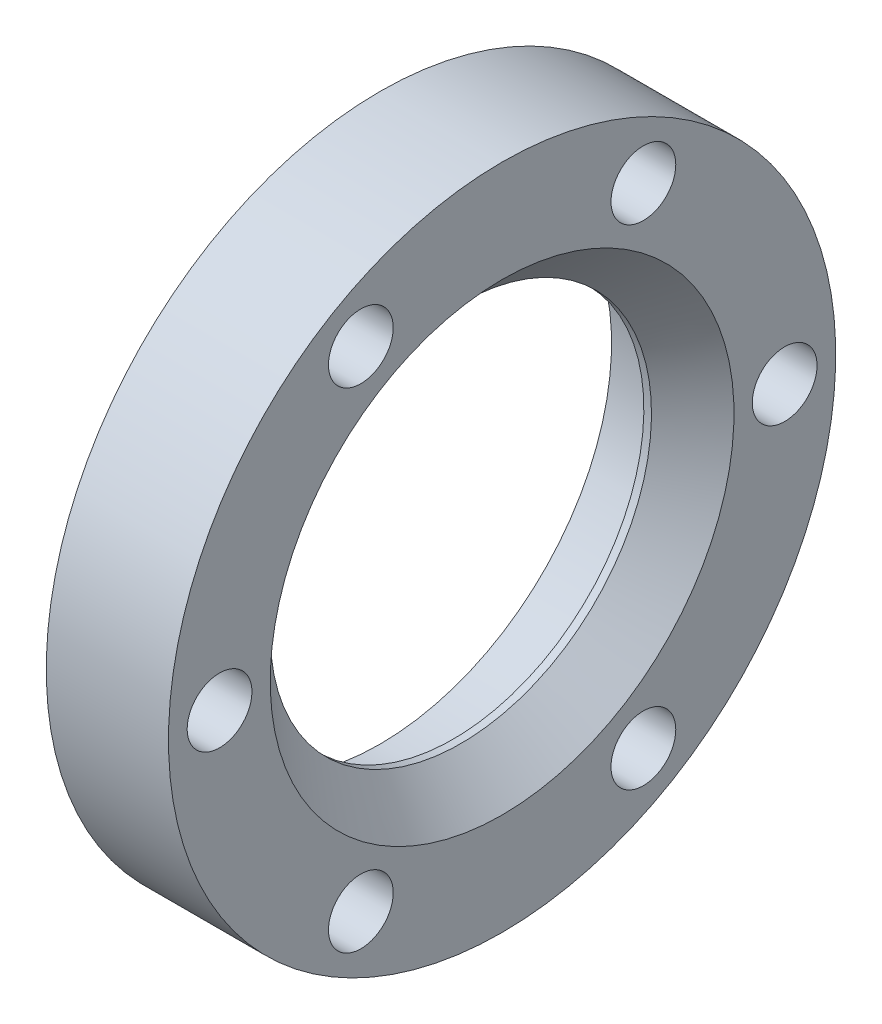
ISO-10303-21;
HEADER;
FILE_DESCRIPTION(('STEP AP214'),'2;1');
FILE_NAME('part.step','',(''),(''),'','','');
FILE_SCHEMA(('AUTOMOTIVE_DESIGN { 1 0 10303 214 1 1 1 1 }'));
ENDSEC;
DATA;
#1=APPLICATION_CONTEXT('core data for automotive mechanical design processes');
#2=APPLICATION_PROTOCOL_DEFINITION('international standard','automotive_design',2000,#1);
#3=PRODUCT_CONTEXT('',#1,'mechanical');
#4=PRODUCT('Part','Part','',(#3));
#5=PRODUCT_RELATED_PRODUCT_CATEGORY('part','',(#4));
#6=PRODUCT_DEFINITION_FORMATION('','',#4);
#7=PRODUCT_DEFINITION_CONTEXT('part definition',#1,'design');
#8=PRODUCT_DEFINITION('design','',#6,#7);
#9=PRODUCT_DEFINITION_SHAPE('','',#8);
#10=(LENGTH_UNIT() NAMED_UNIT(*) SI_UNIT(.MILLI.,.METRE.));
#11=(NAMED_UNIT(*) PLANE_ANGLE_UNIT() SI_UNIT($,.RADIAN.));
#12=(NAMED_UNIT(*) SI_UNIT($,.STERADIAN.) SOLID_ANGLE_UNIT());
#13=UNCERTAINTY_MEASURE_WITH_UNIT(LENGTH_MEASURE(1.E-05),#10,'distance_accuracy_value','');
#14=(GEOMETRIC_REPRESENTATION_CONTEXT(3) GLOBAL_UNCERTAINTY_ASSIGNED_CONTEXT((#13)) GLOBAL_UNIT_ASSIGNED_CONTEXT((#10,
#11,#12)) REPRESENTATION_CONTEXT('',''));
#15=CARTESIAN_POINT('',(0.,0.,0.));
#16=DIRECTION('',(0.,0.,1.));
#17=DIRECTION('',(1.,0.,0.));
#18=AXIS2_PLACEMENT_3D('',#15,#16,#17);
#19=CARTESIAN_POINT('',(8.01687499999896,0.,0.));
#20=DIRECTION('',(1.,0.,0.));
#21=DIRECTION('',(0.,1.,0.));
#22=AXIS2_PLACEMENT_3D('',#19,#20,#21);
#23=CYLINDRICAL_SURFACE('',#22,19.8120000000008);
#24=CARTESIAN_POINT('',(8.41374999807562,0.,0.));
#25=DIRECTION('',(1.,0.,0.));
#26=DIRECTION('',(0.,1.,0.));
#27=AXIS2_PLACEMENT_3D('',#24,#25,#26);
#28=CIRCLE('',#27,19.8120000019241);
#29=CARTESIAN_POINT('',(8.41374999807565,19.8120000019241,0.));
#30=VERTEX_POINT('',#29);
#31=EDGE_CURVE('E76',#30,#30,#28,.T.);
#32=ORIENTED_EDGE('',*,*,#31,.T.);
#33=EDGE_LOOP('',(#32));
#34=FACE_BOUND('',#33,.T.);
#35=CARTESIAN_POINT('',(7.61999999999895,0.,0.));
#36=DIRECTION('',(1.,0.,0.));
#37=DIRECTION('',(0.,1.,0.));
#38=AXIS2_PLACEMENT_3D('',#35,#36,#37);
#39=CIRCLE('',#38,19.8120000000008);
#40=CARTESIAN_POINT('',(7.61999999999898,19.8120000000008,0.));
#41=VERTEX_POINT('',#40);
#42=EDGE_CURVE('E19',#41,#41,#39,.T.);
#43=ORIENTED_EDGE('',*,*,#42,.F.);
#44=EDGE_LOOP('',(#43));
#45=FACE_BOUND('',#44,.T.);
#46=ADVANCED_FACE('F15',(#34,#45),#23,.F.);
#47=CARTESIAN_POINT('',(7.61999999999898,21.9437000000006,0.));
#48=DIRECTION('',(-1.,0.,0.));
#49=DIRECTION('',(0.,0.,1.));
#50=AXIS2_PLACEMENT_3D('',#47,#48,#49);
#51=PLANE('',#50);
#52=ORIENTED_EDGE('',*,*,#42,.T.);
#53=EDGE_LOOP('',(#52));
#54=FACE_BOUND('',#53,.T.);
#55=CARTESIAN_POINT('',(7.61999999999894,0.,0.));
#56=DIRECTION('',(1.,0.,0.));
#57=DIRECTION('',(0.,1.,0.));
#58=AXIS2_PLACEMENT_3D('',#55,#56,#57);
#59=CIRCLE('',#58,24.0754000000004);
#60=CARTESIAN_POINT('',(7.61999999999898,24.0754000000004,0.));
#61=VERTEX_POINT('',#60);
#62=EDGE_CURVE('E74',#61,#61,#59,.F.);
#63=ORIENTED_EDGE('',*,*,#62,.T.);
#64=EDGE_LOOP('',(#63));
#65=FACE_BOUND('',#64,.T.);
#66=ADVANCED_FACE('F85',(#54,#65),#51,.T.);
#67=CARTESIAN_POINT('',(12.7000000019235,0.,0.));
#68=DIRECTION('',(1.,0.,0.));
#69=DIRECTION('',(0.,1.,0.));
#70=AXIS2_PLACEMENT_3D('',#67,#68,#69);
#71=CONICAL_SURFACE('',#70,24.0982499980792,0.78539816250007);
#72=CARTESIAN_POINT('',(12.7000000019235,0.,0.));
#73=DIRECTION('',(1.,0.,0.));
#74=DIRECTION('',(0.,1.,0.));
#75=AXIS2_PLACEMENT_3D('',#72,#73,#74);
#76=CIRCLE('',#75,24.0982499980792);
#77=CARTESIAN_POINT('',(12.7000000019235,24.0982499980792,0.));
#78=VERTEX_POINT('',#77);
#79=EDGE_CURVE('E54',#78,#78,#76,.F.);
#80=ORIENTED_EDGE('',*,*,#79,.F.);
#81=EDGE_LOOP('',(#80));
#82=FACE_BOUND('',#81,.T.);
#83=ORIENTED_EDGE('',*,*,#31,.F.);
#84=EDGE_LOOP('',(#83));
#85=FACE_BOUND('',#84,.T.);
#86=ADVANCED_FACE('F93',(#82,#85),#71,.F.);
#87=CARTESIAN_POINT('',(1.240785174E-13,25.4285843160802,-14.6812));
#88=DIRECTION('',(1.,0.,0.));
#89=DIRECTION('',(0.,0.,-1.));
#90=AXIS2_PLACEMENT_3D('',#87,#88,#89);
#91=CYLINDRICAL_SURFACE('',#90,3.36549999999999);
#92=CARTESIAN_POINT('',(1.35358378E-13,25.4285843160802,-14.6812));
#93=DIRECTION('',(1.,0.,0.));
#94=DIRECTION('',(0.,0.,-1.));
#95=AXIS2_PLACEMENT_3D('',#92,#93,#94);
#96=CIRCLE('',#95,3.36549999999999);
#97=CARTESIAN_POINT('',(1.32693040020406E-13,25.4285843160802,-18.0467));
#98=VERTEX_POINT('',#97);
#99=EDGE_CURVE('E51',#98,#98,#96,.T.);
#100=ORIENTED_EDGE('',*,*,#99,.F.);
#101=EDGE_LOOP('',(#100));
#102=FACE_BOUND('',#101,.T.);
#103=CARTESIAN_POINT('',(12.7000000000002,25.4285843160802,-14.6812));
#104=DIRECTION('',(1.,0.,0.));
#105=DIRECTION('',(0.,0.,-1.));
#106=AXIS2_PLACEMENT_3D('',#103,#104,#105);
#107=CIRCLE('',#106,3.36549999999999);
#108=CARTESIAN_POINT('',(12.7000000000002,25.4285843160802,-18.0467));
#109=VERTEX_POINT('',#108);
#110=EDGE_CURVE('E72',#109,#109,#107,.F.);
#111=ORIENTED_EDGE('',*,*,#110,.F.);
#112=EDGE_LOOP('',(#111));
#113=FACE_BOUND('',#112,.T.);
#114=ADVANCED_FACE('F116',(#102,#113),#91,.F.);
#115=CARTESIAN_POINT('',(0.,0.,-29.3624));
#116=DIRECTION('',(1.,0.,0.));
#117=DIRECTION('',(0.,1.,0.));
#118=AXIS2_PLACEMENT_3D('',#115,#116,#117);
#119=CYLINDRICAL_SURFACE('',#118,3.3655);
#120=CARTESIAN_POINT('',(1.35358378E-13,0.,-29.3624));
#121=DIRECTION('',(1.,0.,0.));
#122=DIRECTION('',(0.,1.,0.));
#123=AXIS2_PLACEMENT_3D('',#120,#121,#122);
#124=CIRCLE('',#123,3.3655);
#125=CARTESIAN_POINT('',(1.414547082E-13,3.3655,-29.3624));
#126=VERTEX_POINT('',#125);
#127=EDGE_CURVE('E48',#126,#126,#124,.T.);
#128=ORIENTED_EDGE('',*,*,#127,.F.);
#129=EDGE_LOOP('',(#128));
#130=FACE_BOUND('',#129,.T.);
#131=CARTESIAN_POINT('',(12.7000000000002,0.,-29.3624));
#132=DIRECTION('',(1.,0.,0.));
#133=DIRECTION('',(0.,1.,0.));
#134=AXIS2_PLACEMENT_3D('',#131,#132,#133);
#135=CIRCLE('',#134,3.3655);
#136=CARTESIAN_POINT('',(12.7000000000002,3.36549999999998,-29.3624));
#137=VERTEX_POINT('',#136);
#138=EDGE_CURVE('E69',#137,#137,#135,.F.);
#139=ORIENTED_EDGE('',*,*,#138,.F.);
#140=EDGE_LOOP('',(#139));
#141=FACE_BOUND('',#140,.T.);
#142=ADVANCED_FACE('F121',(#130,#141),#119,.F.);
#143=CARTESIAN_POINT('',(0.,-25.4285843160802,-14.6812));
#144=DIRECTION('',(1.,0.,0.));
#145=DIRECTION('',(0.,0.,-1.));
#146=AXIS2_PLACEMENT_3D('',#143,#144,#145);
#147=CYLINDRICAL_SURFACE('',#146,3.36549999999999);
#148=CARTESIAN_POINT('',(1.35358378E-13,-25.4285843160802,-14.6812));
#149=DIRECTION('',(1.,0.,0.));
#150=DIRECTION('',(0.,0.,-1.));
#151=AXIS2_PLACEMENT_3D('',#148,#149,#150);
#152=CIRCLE('',#151,3.36549999999999);
#153=CARTESIAN_POINT('',(1.38023707180776E-13,-25.4285843160802,-18.0467));
#154=VERTEX_POINT('',#153);
#155=EDGE_CURVE('E45',#154,#154,#152,.T.);
#156=ORIENTED_EDGE('',*,*,#155,.F.);
#157=EDGE_LOOP('',(#156));
#158=FACE_BOUND('',#157,.T.);
#159=CARTESIAN_POINT('',(12.7000000000002,-25.4285843160802,-14.6812));
#160=DIRECTION('',(1.,0.,0.));
#161=DIRECTION('',(0.,0.,-1.));
#162=AXIS2_PLACEMENT_3D('',#159,#160,#161);
#163=CIRCLE('',#162,3.36549999999999);
#164=CARTESIAN_POINT('',(12.7000000000002,-25.4285843160802,-18.0467));
#165=VERTEX_POINT('',#164);
#166=EDGE_CURVE('E66',#165,#165,#163,.F.);
#167=ORIENTED_EDGE('',*,*,#166,.F.);
#168=EDGE_LOOP('',(#167));
#169=FACE_BOUND('',#168,.T.);
#170=ADVANCED_FACE('F142',(#158,#169),#147,.F.);
#171=CARTESIAN_POINT('',(0.,-25.4285843160802,14.6812));
#172=DIRECTION('',(1.,0.,0.));
#173=DIRECTION('',(0.,0.,-1.));
#174=AXIS2_PLACEMENT_3D('',#171,#172,#173);
#175=CYLINDRICAL_SURFACE('',#174,3.36549999999999);
#176=CARTESIAN_POINT('',(1.35358378E-13,-25.4285843160802,14.6812));
#177=DIRECTION('',(1.,0.,0.));
#178=DIRECTION('',(0.,0.,-1.));
#179=AXIS2_PLACEMENT_3D('',#176,#177,#178);
#180=CIRCLE('',#179,3.36549999999999);
#181=CARTESIAN_POINT('',(1.32795231693552E-13,-25.4285843160802,11.3157));
#182=VERTEX_POINT('',#181);
#183=EDGE_CURVE('E42',#182,#182,#180,.T.);
#184=ORIENTED_EDGE('',*,*,#183,.F.);
#185=EDGE_LOOP('',(#184));
#186=FACE_BOUND('',#185,.T.);
#187=CARTESIAN_POINT('',(12.7000000000002,-25.4285843160802,14.6812));
#188=DIRECTION('',(1.,0.,0.));
#189=DIRECTION('',(0.,0.,-1.));
#190=AXIS2_PLACEMENT_3D('',#187,#188,#189);
#191=CIRCLE('',#190,3.36549999999999);
#192=CARTESIAN_POINT('',(12.7000000000002,-25.4285843160802,11.3157));
#193=VERTEX_POINT('',#192);
#194=EDGE_CURVE('E63',#193,#193,#191,.F.);
#195=ORIENTED_EDGE('',*,*,#194,.F.);
#196=EDGE_LOOP('',(#195));
#197=FACE_BOUND('',#196,.T.);
#198=ADVANCED_FACE('F148',(#186,#197),#175,.F.);
#199=CARTESIAN_POINT('',(1.240785174E-13,25.4285843160802,14.6812));
#200=DIRECTION('',(1.,0.,0.));
#201=DIRECTION('',(0.,0.,-1.));
#202=AXIS2_PLACEMENT_3D('',#199,#200,#201);
#203=CYLINDRICAL_SURFACE('',#202,3.36549999999999);
#204=CARTESIAN_POINT('',(1.35358378E-13,25.4285843160802,14.6812));
#205=DIRECTION('',(1.,0.,0.));
#206=DIRECTION('',(0.,0.,-1.));
#207=AXIS2_PLACEMENT_3D('',#204,#205,#206);
#208=CIRCLE('',#207,3.36549999999999);
#209=CARTESIAN_POINT('',(1.37921517707334E-13,25.4285843160802,11.3157));
#210=VERTEX_POINT('',#209);
#211=EDGE_CURVE('E39',#210,#210,#208,.T.);
#212=ORIENTED_EDGE('',*,*,#211,.F.);
#213=EDGE_LOOP('',(#212));
#214=FACE_BOUND('',#213,.T.);
#215=CARTESIAN_POINT('',(12.7000000000002,25.4285843160802,14.6812));
#216=DIRECTION('',(1.,0.,0.));
#217=DIRECTION('',(0.,0.,-1.));
#218=AXIS2_PLACEMENT_3D('',#215,#216,#217);
#219=CIRCLE('',#218,3.36549999999999);
#220=CARTESIAN_POINT('',(12.7000000000002,25.4285843160802,11.3157));
#221=VERTEX_POINT('',#220);
#222=EDGE_CURVE('E60',#221,#221,#219,.F.);
#223=ORIENTED_EDGE('',*,*,#222,.F.);
#224=EDGE_LOOP('',(#223));
#225=FACE_BOUND('',#224,.T.);
#226=ADVANCED_FACE('F154',(#214,#225),#203,.F.);
#227=CARTESIAN_POINT('',(0.,0.,29.3624));
#228=DIRECTION('',(1.,0.,0.));
#229=DIRECTION('',(0.,1.,0.));
#230=AXIS2_PLACEMENT_3D('',#227,#228,#229);
#231=CYLINDRICAL_SURFACE('',#230,3.3655);
#232=CARTESIAN_POINT('',(1.35358378E-13,0.,29.3624));
#233=DIRECTION('',(1.,0.,0.));
#234=DIRECTION('',(0.,1.,0.));
#235=AXIS2_PLACEMENT_3D('',#232,#233,#234);
#236=CIRCLE('',#235,3.3655);
#237=CARTESIAN_POINT('',(1.413366998E-13,3.3655,29.3624));
#238=VERTEX_POINT('',#237);
#239=EDGE_CURVE('E36',#238,#238,#236,.T.);
#240=ORIENTED_EDGE('',*,*,#239,.F.);
#241=EDGE_LOOP('',(#240));
#242=FACE_BOUND('',#241,.T.);
#243=CARTESIAN_POINT('',(12.7000000000002,0.,29.3624));
#244=DIRECTION('',(1.,0.,0.));
#245=DIRECTION('',(0.,1.,0.));
#246=AXIS2_PLACEMENT_3D('',#243,#244,#245);
#247=CIRCLE('',#246,3.3655);
#248=CARTESIAN_POINT('',(12.7000000000002,3.36549999999998,29.3624));
#249=VERTEX_POINT('',#248);
#250=EDGE_CURVE('E57',#249,#249,#247,.F.);
#251=ORIENTED_EDGE('',*,*,#250,.F.);
#252=EDGE_LOOP('',(#251));
#253=FACE_BOUND('',#252,.T.);
#254=ADVANCED_FACE('F17',(#242,#253),#231,.F.);
#255=CARTESIAN_POINT('',(3.80999999999952,0.,0.));
#256=DIRECTION('',(1.,0.,0.));
#257=DIRECTION('',(0.,1.,0.));
#258=AXIS2_PLACEMENT_3D('',#255,#256,#257);
#259=CYLINDRICAL_SURFACE('',#258,24.0754000000004);
#260=ORIENTED_EDGE('',*,*,#62,.F.);
#261=EDGE_LOOP('',(#260));
#262=FACE_BOUND('',#261,.T.);
#263=CARTESIAN_POINT('',(0.,0.,0.));
#264=DIRECTION('',(1.,0.,0.));
#265=DIRECTION('',(0.,1.,0.));
#266=AXIS2_PLACEMENT_3D('',#263,#264,#265);
#267=CIRCLE('',#266,24.0754000000004);
#268=CARTESIAN_POINT('',(1.35140530413566E-13,24.0754000000004,0.));
#269=VERTEX_POINT('',#268);
#270=EDGE_CURVE('E28',#269,#269,#267,.T.);
#271=ORIENTED_EDGE('',*,*,#270,.F.);
#272=EDGE_LOOP('',(#271));
#273=FACE_BOUND('',#272,.T.);
#274=ADVANCED_FACE('F110',(#262,#273),#259,.F.);
#275=CARTESIAN_POINT('',(12.7000000000002,29.3846250000013,0.));
#276=DIRECTION('',(1.,0.,0.));
#277=DIRECTION('',(0.,0.,-1.));
#278=AXIS2_PLACEMENT_3D('',#275,#276,#277);
#279=PLANE('',#278);
#280=ORIENTED_EDGE('',*,*,#79,.T.);
#281=EDGE_LOOP('',(#280));
#282=FACE_BOUND('',#281,.T.);
#283=ORIENTED_EDGE('',*,*,#250,.T.);
#284=EDGE_LOOP('',(#283));
#285=FACE_BOUND('',#284,.T.);
#286=ORIENTED_EDGE('',*,*,#222,.T.);
#287=EDGE_LOOP('',(#286));
#288=FACE_BOUND('',#287,.T.);
#289=ORIENTED_EDGE('',*,*,#194,.T.);
#290=EDGE_LOOP('',(#289));
#291=FACE_BOUND('',#290,.T.);
#292=ORIENTED_EDGE('',*,*,#166,.T.);
#293=EDGE_LOOP('',(#292));
#294=FACE_BOUND('',#293,.T.);
#295=ORIENTED_EDGE('',*,*,#138,.T.);
#296=EDGE_LOOP('',(#295));
#297=FACE_BOUND('',#296,.T.);
#298=ORIENTED_EDGE('',*,*,#110,.T.);
#299=EDGE_LOOP('',(#298));
#300=FACE_BOUND('',#299,.T.);
#301=CARTESIAN_POINT('',(12.7000000000001,0.,0.));
#302=DIRECTION('',(1.,0.,0.));
#303=DIRECTION('',(0.,1.,0.));
#304=AXIS2_PLACEMENT_3D('',#301,#302,#303);
#305=CIRCLE('',#304,34.6710000000002);
#306=CARTESIAN_POINT('',(12.7000000000002,34.6710000000002,0.));
#307=VERTEX_POINT('',#306);
#308=EDGE_CURVE('E23',#307,#307,#305,.F.);
#309=ORIENTED_EDGE('',*,*,#308,.F.);
#310=EDGE_LOOP('',(#309));
#311=FACE_BOUND('',#310,.T.);
#312=ADVANCED_FACE('F103',(#282,#285,#288,#291,#294,#297,#300,#311),#279,.T.);
#313=CARTESIAN_POINT('',(1.35358378E-13,29.3732000000003,0.));
#314=DIRECTION('',(-1.,0.,0.));
#315=DIRECTION('',(0.,0.,1.));
#316=AXIS2_PLACEMENT_3D('',#313,#314,#315);
#317=PLANE('',#316);
#318=ORIENTED_EDGE('',*,*,#270,.T.);
#319=EDGE_LOOP('',(#318));
#320=FACE_BOUND('',#319,.T.);
#321=ORIENTED_EDGE('',*,*,#239,.T.);
#322=EDGE_LOOP('',(#321));
#323=FACE_BOUND('',#322,.T.);
#324=ORIENTED_EDGE('',*,*,#211,.T.);
#325=EDGE_LOOP('',(#324));
#326=FACE_BOUND('',#325,.T.);
#327=ORIENTED_EDGE('',*,*,#183,.T.);
#328=EDGE_LOOP('',(#327));
#329=FACE_BOUND('',#328,.T.);
#330=ORIENTED_EDGE('',*,*,#155,.T.);
#331=EDGE_LOOP('',(#330));
#332=FACE_BOUND('',#331,.T.);
#333=ORIENTED_EDGE('',*,*,#127,.T.);
#334=EDGE_LOOP('',(#333));
#335=FACE_BOUND('',#334,.T.);
#336=ORIENTED_EDGE('',*,*,#99,.T.);
#337=EDGE_LOOP('',(#336));
#338=FACE_BOUND('',#337,.T.);
#339=CARTESIAN_POINT('',(0.,0.,0.));
#340=DIRECTION('',(1.,0.,0.));
#341=DIRECTION('',(0.,1.,0.));
#342=AXIS2_PLACEMENT_3D('',#339,#340,#341);
#343=CIRCLE('',#342,34.6710000000002);
#344=CARTESIAN_POINT('',(1.35313821276015E-13,34.6710000000002,0.));
#345=VERTEX_POINT('',#344);
#346=EDGE_CURVE('E10',#345,#345,#343,.T.);
#347=ORIENTED_EDGE('',*,*,#346,.F.);
#348=EDGE_LOOP('',(#347));
#349=FACE_BOUND('',#348,.T.);
#350=ADVANCED_FACE('F98',(#320,#323,#326,#329,#332,#335,#338,#349),#317,.T.);
#351=CARTESIAN_POINT('',(6.3500000000001,0.,0.));
#352=DIRECTION('',(1.,0.,0.));
#353=DIRECTION('',(0.,1.,0.));
#354=AXIS2_PLACEMENT_3D('',#351,#352,#353);
#355=CYLINDRICAL_SURFACE('',#354,34.6710000000002);
#356=ORIENTED_EDGE('',*,*,#346,.T.);
#357=EDGE_LOOP('',(#356));
#358=FACE_BOUND('',#357,.T.);
#359=ORIENTED_EDGE('',*,*,#308,.T.);
#360=EDGE_LOOP('',(#359));
#361=FACE_BOUND('',#360,.T.);
#362=ADVANCED_FACE('F96',(#358,#361),#355,.T.);
#363=CLOSED_SHELL('',(#46,#66,#86,#114,#142,#170,#198,#226,#254,#274,#312,#350,#362));
#364=MANIFOLD_SOLID_BREP('B1',#363);
#365=ADVANCED_BREP_SHAPE_REPRESENTATION('',(#18,#364),#14);
#366=SHAPE_DEFINITION_REPRESENTATION(#9,#365);
ENDSEC;
END-ISO-10303-21;
